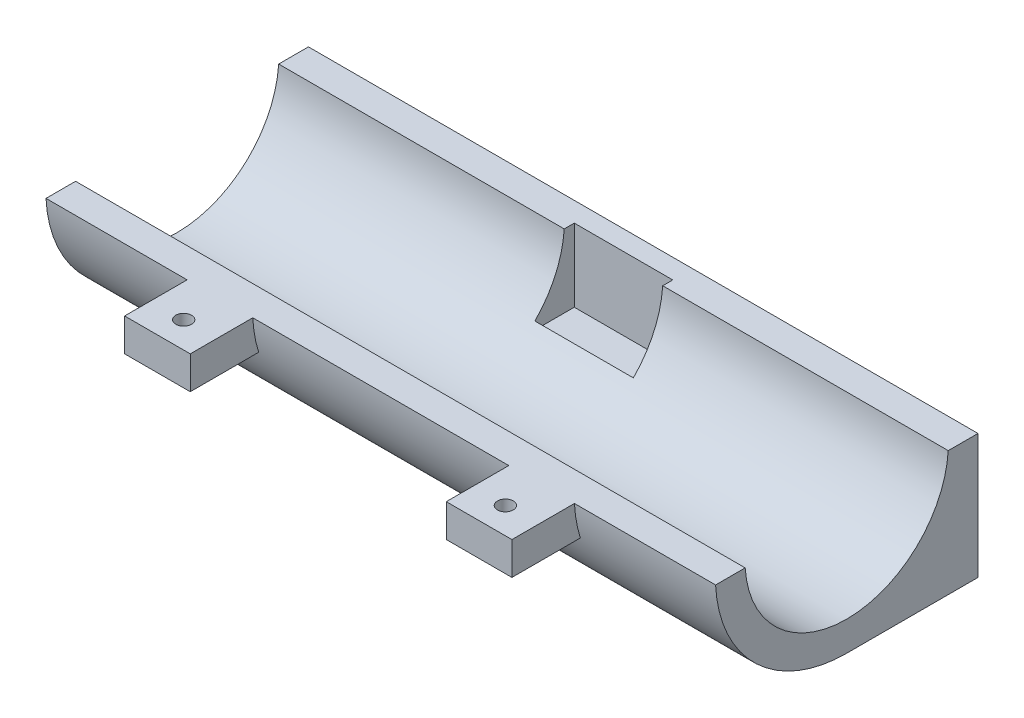
ISO-10303-21;
HEADER;
FILE_DESCRIPTION(('STEP AP214'),'2;1');
FILE_NAME('part.step','',(''),(''),'','','');
FILE_SCHEMA(('AUTOMOTIVE_DESIGN { 1 0 10303 214 1 1 1 1 }'));
ENDSEC;
DATA;
#1=APPLICATION_CONTEXT('core data for automotive mechanical design processes');
#2=APPLICATION_PROTOCOL_DEFINITION('international standard','automotive_design',2000,#1);
#3=PRODUCT_CONTEXT('',#1,'mechanical');
#4=PRODUCT('Part','Part','',(#3));
#5=PRODUCT_RELATED_PRODUCT_CATEGORY('part','',(#4));
#6=PRODUCT_DEFINITION_FORMATION('','',#4);
#7=PRODUCT_DEFINITION_CONTEXT('part definition',#1,'design');
#8=PRODUCT_DEFINITION('design','',#6,#7);
#9=PRODUCT_DEFINITION_SHAPE('','',#8);
#10=(LENGTH_UNIT() NAMED_UNIT(*) SI_UNIT(.MILLI.,.METRE.));
#11=(NAMED_UNIT(*) PLANE_ANGLE_UNIT() SI_UNIT($,.RADIAN.));
#12=(NAMED_UNIT(*) SI_UNIT($,.STERADIAN.) SOLID_ANGLE_UNIT());
#13=UNCERTAINTY_MEASURE_WITH_UNIT(LENGTH_MEASURE(1.E-05),#10,'distance_accuracy_value','');
#14=(GEOMETRIC_REPRESENTATION_CONTEXT(3) GLOBAL_UNCERTAINTY_ASSIGNED_CONTEXT((#13)) GLOBAL_UNIT_ASSIGNED_CONTEXT((#10,
#11,#12)) REPRESENTATION_CONTEXT('',''));
#15=CARTESIAN_POINT('',(0.,0.,0.));
#16=DIRECTION('',(0.,0.,1.));
#17=DIRECTION('',(1.,0.,0.));
#18=AXIS2_PLACEMENT_3D('',#15,#16,#17);
#19=CARTESIAN_POINT('',(0.,1.14590202813815,3.94518317727533));
#20=DIRECTION('',(1.,0.,0.));
#21=DIRECTION('',(0.,0.,-1.));
#22=AXIS2_PLACEMENT_3D('',#19,#20,#21);
#23=CYLINDRICAL_SURFACE('',#22,10.);
#24=CARTESIAN_POINT('',(51.,1.14590202813815,3.94518317727533));
#25=DIRECTION('',(-1.,0.,0.));
#26=DIRECTION('',(0.,0.,-1.));
#27=AXIS2_PLACEMENT_3D('',#24,#25,#26);
#28=CIRCLE('',#27,10.);
#29=CARTESIAN_POINT('',(51.,-8.85409797186184,3.94518317727534));
#30=VERTEX_POINT('',#29);
#31=CARTESIAN_POINT('',(51.,0.645902028138152,13.9326753549944));
#32=VERTEX_POINT('',#31);
#33=EDGE_CURVE('E183',#30,#32,#28,.T.);
#34=ORIENTED_EDGE('',*,*,#33,.T.);
#35=DIRECTION('',(1.,0.,0.));
#36=VECTOR('',#35,1.);
#37=CARTESIAN_POINT('',(0.,0.645902028138152,13.9326753549944));
#38=LINE('',#37,#36);
#39=CARTESIAN_POINT('',(40.25,0.645902028138152,13.9326753549944));
#40=VERTEX_POINT('',#39);
#41=EDGE_CURVE('E163',#32,#40,#38,.F.);
#42=ORIENTED_EDGE('',*,*,#41,.T.);
#43=CARTESIAN_POINT('',(40.25,1.14590202813815,3.94518317727533));
#44=DIRECTION('',(-1.,0.,0.));
#45=DIRECTION('',(0.,0.,-1.));
#46=AXIS2_PLACEMENT_3D('',#43,#44,#45);
#47=CIRCLE('',#46,10.);
#48=CARTESIAN_POINT('',(40.25,-1.85409797186185,13.4845751914448));
#49=VERTEX_POINT('',#48);
#50=EDGE_CURVE('E249',#49,#40,#47,.T.);
#51=ORIENTED_EDGE('',*,*,#50,.F.);
#52=DIRECTION('',(1.,0.,0.));
#53=VECTOR('',#52,1.);
#54=CARTESIAN_POINT('',(0.,-1.85409797186185,13.4845751914448));
#55=LINE('',#54,#53);
#56=CARTESIAN_POINT('',(35.25,-1.85409797186185,13.4845751914448));
#57=VERTEX_POINT('',#56);
#58=EDGE_CURVE('E11',#49,#57,#55,.F.);
#59=ORIENTED_EDGE('',*,*,#58,.T.);
#60=CARTESIAN_POINT('',(35.25,1.14590202813815,3.94518317727533));
#61=DIRECTION('',(1.,0.,0.));
#62=DIRECTION('',(0.,0.,1.));
#63=AXIS2_PLACEMENT_3D('',#60,#61,#62);
#64=CIRCLE('',#63,10.);
#65=CARTESIAN_POINT('',(35.25,0.645902028138152,13.9326753549944));
#66=VERTEX_POINT('',#65);
#67=EDGE_CURVE('E356',#66,#57,#64,.T.);
#68=ORIENTED_EDGE('',*,*,#67,.F.);
#69=CARTESIAN_POINT('',(15.75,0.645902028138152,13.9326753549944));
#70=VERTEX_POINT('',#69);
#71=EDGE_CURVE('E177',#66,#70,#38,.F.);
#72=ORIENTED_EDGE('',*,*,#71,.T.);
#73=CARTESIAN_POINT('',(15.75,1.14590202813815,3.94518317727533));
#74=DIRECTION('',(-1.,0.,0.));
#75=DIRECTION('',(0.,0.,-1.));
#76=AXIS2_PLACEMENT_3D('',#73,#74,#75);
#77=CIRCLE('',#76,10.);
#78=CARTESIAN_POINT('',(15.75,-1.85409797186185,13.4845751914448));
#79=VERTEX_POINT('',#78);
#80=EDGE_CURVE('E238',#79,#70,#77,.T.);
#81=ORIENTED_EDGE('',*,*,#80,.F.);
#82=CARTESIAN_POINT('',(10.75,-1.85409797186185,13.4845751914448));
#83=VERTEX_POINT('',#82);
#84=EDGE_CURVE('E42',#79,#83,#55,.F.);
#85=ORIENTED_EDGE('',*,*,#84,.T.);
#86=CARTESIAN_POINT('',(10.75,1.14590202813815,3.94518317727533));
#87=DIRECTION('',(1.,0.,0.));
#88=DIRECTION('',(0.,0.,1.));
#89=AXIS2_PLACEMENT_3D('',#86,#87,#88);
#90=CIRCLE('',#89,10.);
#91=CARTESIAN_POINT('',(10.75,0.645902028138152,13.9326753549944));
#92=VERTEX_POINT('',#91);
#93=EDGE_CURVE('E235',#92,#83,#90,.T.);
#94=ORIENTED_EDGE('',*,*,#93,.F.);
#95=CARTESIAN_POINT('',(0.,0.645902028138152,13.9326753549944));
#96=VERTEX_POINT('',#95);
#97=EDGE_CURVE('E176',#92,#96,#38,.F.);
#98=ORIENTED_EDGE('',*,*,#97,.T.);
#99=CARTESIAN_POINT('',(0.,1.14590202813815,3.94518317727533));
#100=DIRECTION('',(-1.,0.,0.));
#101=DIRECTION('',(0.,0.,-1.));
#102=AXIS2_PLACEMENT_3D('',#99,#100,#101);
#103=CIRCLE('',#102,10.);
#104=CARTESIAN_POINT('',(0.,-8.85409797186184,3.94518317727534));
#105=VERTEX_POINT('',#104);
#106=EDGE_CURVE('E193',#105,#96,#103,.T.);
#107=ORIENTED_EDGE('',*,*,#106,.F.);
#108=DIRECTION('',(1.,0.,0.));
#109=VECTOR('',#108,1.);
#110=CARTESIAN_POINT('',(0.,-8.85409797186184,3.94518317727534));
#111=LINE('',#110,#109);
#112=EDGE_CURVE('E192',#105,#30,#111,.T.);
#113=ORIENTED_EDGE('',*,*,#112,.T.);
#114=EDGE_LOOP('',(#34,#42,#51,#59,#68,#72,#81,#85,#94,#98,#107,#113));
#115=FACE_BOUND('',#114,.T.);
#116=ADVANCED_FACE('F33',(#115),#23,.T.);
#117=CARTESIAN_POINT('',(0.,-1.85409797186185,11.6951831772753));
#118=DIRECTION('',(0.,-1.,0.));
#119=DIRECTION('',(0.,0.,-1.));
#120=AXIS2_PLACEMENT_3D('',#117,#118,#119);
#121=PLANE('',#120);
#122=CARTESIAN_POINT('',(13.25,-1.85409797186185,16.6951831772753));
#123=DIRECTION('',(0.,-1.,0.));
#124=DIRECTION('',(0.,0.,-1.));
#125=AXIS2_PLACEMENT_3D('',#122,#123,#124);
#126=CIRCLE('',#125,0.6);
#127=CARTESIAN_POINT('',(13.25,-1.85409797186185,16.0951831772753));
#128=VERTEX_POINT('',#127);
#129=EDGE_CURVE('E302',#128,#128,#126,.T.);
#130=ORIENTED_EDGE('',*,*,#129,.F.);
#131=EDGE_LOOP('',(#130));
#132=FACE_BOUND('',#131,.T.);
#133=ORIENTED_EDGE('',*,*,#84,.F.);
#134=DIRECTION('',(0.,0.,-1.));
#135=VECTOR('',#134,1.);
#136=CARTESIAN_POINT('',(15.75,-1.85409797186185,13.4845751914448));
#137=LINE('',#136,#135);
#138=CARTESIAN_POINT('',(15.75,-1.85409797186185,18.6951831772753));
#139=VERTEX_POINT('',#138);
#140=EDGE_CURVE('E361',#139,#79,#137,.T.);
#141=ORIENTED_EDGE('',*,*,#140,.F.);
#142=DIRECTION('',(1.,0.,0.));
#143=VECTOR('',#142,1.);
#144=CARTESIAN_POINT('',(10.75,-1.85409797186185,18.6951831772753));
#145=LINE('',#144,#143);
#146=CARTESIAN_POINT('',(10.75,-1.85409797186185,18.6951831772753));
#147=VERTEX_POINT('',#146);
#148=EDGE_CURVE('E246',#147,#139,#145,.T.);
#149=ORIENTED_EDGE('',*,*,#148,.F.);
#150=DIRECTION('',(0.,0.,1.));
#151=VECTOR('',#150,1.);
#152=CARTESIAN_POINT('',(10.75,-1.85409797186185,17.6951831772753));
#153=LINE('',#152,#151);
#154=EDGE_CURVE('E243',#83,#147,#153,.T.);
#155=ORIENTED_EDGE('',*,*,#154,.F.);
#156=EDGE_LOOP('',(#133,#141,#149,#155));
#157=FACE_BOUND('',#156,.T.);
#158=ADVANCED_FACE('F244',(#132,#157),#121,.T.);
#159=CARTESIAN_POINT('',(37.75,-1.85409797186185,16.6951831772753));
#160=DIRECTION('',(0.,-1.,0.));
#161=DIRECTION('',(0.,0.,-1.));
#162=AXIS2_PLACEMENT_3D('',#159,#160,#161);
#163=CIRCLE('',#162,0.6);
#164=CARTESIAN_POINT('',(37.75,-1.85409797186185,16.0951831772753));
#165=VERTEX_POINT('',#164);
#166=EDGE_CURVE('E298',#165,#165,#163,.T.);
#167=ORIENTED_EDGE('',*,*,#166,.F.);
#168=EDGE_LOOP('',(#167));
#169=FACE_BOUND('',#168,.T.);
#170=DIRECTION('',(0.,0.,-1.));
#171=VECTOR('',#170,1.);
#172=CARTESIAN_POINT('',(40.25,-1.85409797186185,17.6951831772753));
#173=LINE('',#172,#171);
#174=CARTESIAN_POINT('',(40.25,-1.85409797186185,18.6951831772753));
#175=VERTEX_POINT('',#174);
#176=EDGE_CURVE('E251',#175,#49,#173,.T.);
#177=ORIENTED_EDGE('',*,*,#176,.F.);
#178=DIRECTION('',(1.,0.,0.));
#179=VECTOR('',#178,1.);
#180=CARTESIAN_POINT('',(35.25,-1.85409797186185,18.6951831772753));
#181=LINE('',#180,#179);
#182=CARTESIAN_POINT('',(35.25,-1.85409797186185,18.6951831772753));
#183=VERTEX_POINT('',#182);
#184=EDGE_CURVE('E350',#183,#175,#181,.T.);
#185=ORIENTED_EDGE('',*,*,#184,.F.);
#186=DIRECTION('',(0.,0.,1.));
#187=VECTOR('',#186,1.);
#188=CARTESIAN_POINT('',(35.25,-1.85409797186185,17.6951831772753));
#189=LINE('',#188,#187);
#190=EDGE_CURVE('E358',#57,#183,#189,.T.);
#191=ORIENTED_EDGE('',*,*,#190,.F.);
#192=ORIENTED_EDGE('',*,*,#58,.F.);
#193=EDGE_LOOP('',(#177,#185,#191,#192));
#194=FACE_BOUND('',#193,.T.);
#195=ADVANCED_FACE('F385',(#169,#194),#121,.T.);
#196=CARTESIAN_POINT('',(0.,1.14590202813815,3.94518317727533));
#197=DIRECTION('',(1.,0.,0.));
#198=DIRECTION('',(0.,0.,-1.));
#199=AXIS2_PLACEMENT_3D('',#196,#197,#198);
#200=CYLINDRICAL_SURFACE('',#199,7.75);
#201=CARTESIAN_POINT('',(51.,1.14590202813815,3.94518317727533));
#202=DIRECTION('',(1.,0.,0.));
#203=DIRECTION('',(0.,0.,-1.));
#204=AXIS2_PLACEMENT_3D('',#201,#202,#203);
#205=CIRCLE('',#204,7.75);
#206=CARTESIAN_POINT('',(51.,0.645902028138152,11.6790373264043));
#207=VERTEX_POINT('',#206);
#208=CARTESIAN_POINT('',(51.,0.645902028138152,-3.78867097185367));
#209=VERTEX_POINT('',#208);
#210=EDGE_CURVE('E187',#207,#209,#205,.T.);
#211=ORIENTED_EDGE('',*,*,#210,.T.);
#212=DIRECTION('',(1.,0.,0.));
#213=VECTOR('',#212,1.);
#214=CARTESIAN_POINT('',(0.,0.645902028138152,-3.78867097185367));
#215=LINE('',#214,#213);
#216=CARTESIAN_POINT('',(29.25,0.645902028138152,-3.78867097185367));
#217=VERTEX_POINT('',#216);
#218=EDGE_CURVE('E297',#209,#217,#215,.F.);
#219=ORIENTED_EDGE('',*,*,#218,.T.);
#220=CARTESIAN_POINT('',(29.25,1.14590202813815,3.94518317727533));
#221=DIRECTION('',(-1.,0.,0.));
#222=DIRECTION('',(0.,0.,1.));
#223=AXIS2_PLACEMENT_3D('',#220,#221,#222);
#224=CIRCLE('',#223,7.75);
#225=CARTESIAN_POINT('',(29.25,-4.31418038882224,-1.55481682272466));
#226=VERTEX_POINT('',#225);
#227=EDGE_CURVE('E224',#226,#217,#224,.F.);
#228=ORIENTED_EDGE('',*,*,#227,.F.);
#229=DIRECTION('',(1.,0.,0.));
#230=VECTOR('',#229,1.);
#231=CARTESIAN_POINT('',(0.,-4.31418038882224,-1.55481682272466));
#232=LINE('',#231,#230);
#233=CARTESIAN_POINT('',(21.75,-4.31418038882224,-1.55481682272466));
#234=VERTEX_POINT('',#233);
#235=EDGE_CURVE('E217',#226,#234,#232,.F.);
#236=ORIENTED_EDGE('',*,*,#235,.T.);
#237=CARTESIAN_POINT('',(21.75,1.14590202813815,3.94518317727533));
#238=DIRECTION('',(1.,0.,0.));
#239=DIRECTION('',(0.,0.,-1.));
#240=AXIS2_PLACEMENT_3D('',#237,#238,#239);
#241=CIRCLE('',#240,7.75);
#242=CARTESIAN_POINT('',(21.75,0.645902028138152,-3.78867097185367));
#243=VERTEX_POINT('',#242);
#244=EDGE_CURVE('E222',#243,#234,#241,.F.);
#245=ORIENTED_EDGE('',*,*,#244,.F.);
#246=CARTESIAN_POINT('',(0.,0.645902028138152,-3.78867097185367));
#247=VERTEX_POINT('',#246);
#248=EDGE_CURVE('E49',#243,#247,#215,.F.);
#249=ORIENTED_EDGE('',*,*,#248,.T.);
#250=CARTESIAN_POINT('',(0.,1.14590202813815,3.94518317727533));
#251=DIRECTION('',(1.,0.,0.));
#252=DIRECTION('',(0.,0.,-1.));
#253=AXIS2_PLACEMENT_3D('',#250,#251,#252);
#254=CIRCLE('',#253,7.75);
#255=CARTESIAN_POINT('',(0.,0.645902028138152,11.6790373264043));
#256=VERTEX_POINT('',#255);
#257=EDGE_CURVE('E210',#256,#247,#254,.T.);
#258=ORIENTED_EDGE('',*,*,#257,.F.);
#259=DIRECTION('',(1.,0.,0.));
#260=VECTOR('',#259,1.);
#261=CARTESIAN_POINT('',(0.,0.645902028138152,11.6790373264043));
#262=LINE('',#261,#260);
#263=EDGE_CURVE('E312',#256,#207,#262,.T.);
#264=ORIENTED_EDGE('',*,*,#263,.T.);
#265=EDGE_LOOP('',(#211,#219,#228,#236,#245,#249,#258,#264));
#266=FACE_BOUND('',#265,.T.);
#267=ADVANCED_FACE('F294',(#266),#200,.F.);
#268=CARTESIAN_POINT('',(0.,21.1459020281382,-6.05481682272466));
#269=DIRECTION('',(0.,0.,1.));
#270=DIRECTION('',(0.,-1.,0.));
#271=AXIS2_PLACEMENT_3D('',#268,#269,#270);
#272=PLANE('',#271);
#273=DIRECTION('',(0.,-1.,0.));
#274=VECTOR('',#273,1.);
#275=CARTESIAN_POINT('',(0.,21.1459020281382,-6.05481682272466));
#276=LINE('',#275,#274);
#277=CARTESIAN_POINT('',(0.,0.645902028138152,-6.05481682272466));
#278=VERTEX_POINT('',#277);
#279=CARTESIAN_POINT('',(0.,-8.85409797186185,-6.05481682272466));
#280=VERTEX_POINT('',#279);
#281=EDGE_CURVE('E204',#278,#280,#276,.T.);
#282=ORIENTED_EDGE('',*,*,#281,.F.);
#283=DIRECTION('',(1.,0.,0.));
#284=VECTOR('',#283,1.);
#285=CARTESIAN_POINT('',(0.,0.645902028138152,-6.05481682272466));
#286=LINE('',#285,#284);
#287=CARTESIAN_POINT('',(51.,0.645902028138152,-6.05481682272466));
#288=VERTEX_POINT('',#287);
#289=EDGE_CURVE('E299',#278,#288,#286,.T.);
#290=ORIENTED_EDGE('',*,*,#289,.T.);
#291=DIRECTION('',(0.,-1.,0.));
#292=VECTOR('',#291,1.);
#293=CARTESIAN_POINT('',(51.,21.1459020281382,-6.05481682272466));
#294=LINE('',#293,#292);
#295=CARTESIAN_POINT('',(51.,-8.85409797186185,-6.05481682272466));
#296=VERTEX_POINT('',#295);
#297=EDGE_CURVE('E203',#288,#296,#294,.T.);
#298=ORIENTED_EDGE('',*,*,#297,.T.);
#299=DIRECTION('',(1.,0.,0.));
#300=VECTOR('',#299,1.);
#301=CARTESIAN_POINT('',(0.,-8.85409797186185,-6.05481682272466));
#302=LINE('',#301,#300);
#303=EDGE_CURVE('E206',#280,#296,#302,.T.);
#304=ORIENTED_EDGE('',*,*,#303,.F.);
#305=EDGE_LOOP('',(#282,#290,#298,#304));
#306=FACE_BOUND('',#305,.T.);
#307=ADVANCED_FACE('F331',(#306),#272,.F.);
#308=CARTESIAN_POINT('',(51.,-8.85409797186185,20.9451831772753));
#309=DIRECTION('',(0.,1.,0.));
#310=DIRECTION('',(0.,0.,1.));
#311=AXIS2_PLACEMENT_3D('',#308,#309,#310);
#312=PLANE('',#311);
#313=DIRECTION('',(0.,0.,-1.));
#314=VECTOR('',#313,1.);
#315=CARTESIAN_POINT('',(51.,-8.85409797186185,20.9451831772753));
#316=LINE('',#315,#314);
#317=EDGE_CURVE('E215',#30,#296,#316,.T.);
#318=ORIENTED_EDGE('',*,*,#317,.F.);
#319=ORIENTED_EDGE('',*,*,#112,.F.);
#320=DIRECTION('',(0.,0.,-1.));
#321=VECTOR('',#320,1.);
#322=CARTESIAN_POINT('',(0.,-8.85409797186185,20.9451831772753));
#323=LINE('',#322,#321);
#324=EDGE_CURVE('E213',#105,#280,#323,.T.);
#325=ORIENTED_EDGE('',*,*,#324,.T.);
#326=ORIENTED_EDGE('',*,*,#303,.T.);
#327=EDGE_LOOP('',(#318,#319,#325,#326));
#328=FACE_BOUND('',#327,.T.);
#329=ADVANCED_FACE('F35',(#328),#312,.F.);
#330=CARTESIAN_POINT('',(51.,0.,0.));
#331=DIRECTION('',(1.,0.,0.));
#332=DIRECTION('',(0.,0.,-1.));
#333=AXIS2_PLACEMENT_3D('',#330,#331,#332);
#334=PLANE('',#333);
#335=DIRECTION('',(0.,0.,-1.));
#336=VECTOR('',#335,1.);
#337=CARTESIAN_POINT('',(51.,0.645902028138152,18.6951831772753));
#338=LINE('',#337,#336);
#339=EDGE_CURVE('E166',#32,#207,#338,.T.);
#340=ORIENTED_EDGE('',*,*,#339,.F.);
#341=ORIENTED_EDGE('',*,*,#33,.F.);
#342=ORIENTED_EDGE('',*,*,#317,.T.);
#343=ORIENTED_EDGE('',*,*,#297,.F.);
#344=EDGE_CURVE('E189',#209,#288,#338,.T.);
#345=ORIENTED_EDGE('',*,*,#344,.F.);
#346=ORIENTED_EDGE('',*,*,#210,.F.);
#347=EDGE_LOOP('',(#340,#341,#342,#343,#345,#346));
#348=FACE_BOUND('',#347,.T.);
#349=ADVANCED_FACE('F181',(#348),#334,.T.);
#350=CARTESIAN_POINT('',(0.,0.,0.));
#351=DIRECTION('',(1.,0.,0.));
#352=DIRECTION('',(0.,0.,-1.));
#353=AXIS2_PLACEMENT_3D('',#350,#351,#352);
#354=PLANE('',#353);
#355=ORIENTED_EDGE('',*,*,#106,.T.);
#356=DIRECTION('',(0.,0.,-1.));
#357=VECTOR('',#356,1.);
#358=CARTESIAN_POINT('',(0.,0.645902028138152,0.));
#359=LINE('',#358,#357);
#360=EDGE_CURVE('E314',#96,#256,#359,.T.);
#361=ORIENTED_EDGE('',*,*,#360,.T.);
#362=ORIENTED_EDGE('',*,*,#257,.T.);
#363=EDGE_CURVE('E305',#247,#278,#359,.T.);
#364=ORIENTED_EDGE('',*,*,#363,.T.);
#365=ORIENTED_EDGE('',*,*,#281,.T.);
#366=ORIENTED_EDGE('',*,*,#324,.F.);
#367=EDGE_LOOP('',(#355,#361,#362,#364,#365,#366));
#368=FACE_BOUND('',#367,.T.);
#369=ADVANCED_FACE('F336',(#368),#354,.F.);
#370=CARTESIAN_POINT('',(0.,0.,-4.55481682272466));
#371=DIRECTION('',(0.,0.,1.));
#372=DIRECTION('',(0.,-1.,0.));
#373=AXIS2_PLACEMENT_3D('',#370,#371,#372);
#374=PLANE('',#373);
#375=DIRECTION('',(1.,0.,0.));
#376=VECTOR('',#375,1.);
#377=CARTESIAN_POINT('',(0.,0.645902028138152,-4.55481682272466));
#378=LINE('',#377,#376);
#379=CARTESIAN_POINT('',(21.75,0.645902028138152,-4.55481682272466));
#380=VERTEX_POINT('',#379);
#381=CARTESIAN_POINT('',(29.25,0.645902028138152,-4.55481682272466));
#382=VERTEX_POINT('',#381);
#383=EDGE_CURVE('E291',#380,#382,#378,.T.);
#384=ORIENTED_EDGE('',*,*,#383,.F.);
#385=DIRECTION('',(0.,1.,0.));
#386=VECTOR('',#385,1.);
#387=CARTESIAN_POINT('',(21.75,-2.18013164577437,-4.55481682272466));
#388=LINE('',#387,#386);
#389=CARTESIAN_POINT('',(21.75,-4.90409797186185,-4.55481682272466));
#390=VERTEX_POINT('',#389);
#391=EDGE_CURVE('E266',#390,#380,#388,.T.);
#392=ORIENTED_EDGE('',*,*,#391,.F.);
#393=DIRECTION('',(-1.,0.,0.));
#394=VECTOR('',#393,1.);
#395=CARTESIAN_POINT('',(21.75,-4.90409797186185,-4.55481682272466));
#396=LINE('',#395,#394);
#397=CARTESIAN_POINT('',(29.25,-4.90409797186185,-4.55481682272466));
#398=VERTEX_POINT('',#397);
#399=EDGE_CURVE('E271',#398,#390,#396,.T.);
#400=ORIENTED_EDGE('',*,*,#399,.F.);
#401=DIRECTION('',(0.,-1.,0.));
#402=VECTOR('',#401,1.);
#403=CARTESIAN_POINT('',(29.25,-2.18013164577437,-4.55481682272466));
#404=LINE('',#403,#402);
#405=EDGE_CURVE('E269',#382,#398,#404,.T.);
#406=ORIENTED_EDGE('',*,*,#405,.F.);
#407=EDGE_LOOP('',(#384,#392,#400,#406));
#408=FACE_BOUND('',#407,.T.);
#409=ADVANCED_FACE('F290',(#408),#374,.T.);
#410=CARTESIAN_POINT('',(29.25,-2.18013164577437,-4.55481682272466));
#411=DIRECTION('',(-1.,0.,0.));
#412=DIRECTION('',(0.,0.,1.));
#413=AXIS2_PLACEMENT_3D('',#410,#411,#412);
#414=PLANE('',#413);
#415=DIRECTION('',(0.,0.,1.));
#416=VECTOR('',#415,1.);
#417=CARTESIAN_POINT('',(29.25,0.645902028138152,-4.55481682272466));
#418=LINE('',#417,#416);
#419=EDGE_CURVE('E309',#382,#217,#418,.T.);
#420=ORIENTED_EDGE('',*,*,#419,.F.);
#421=ORIENTED_EDGE('',*,*,#405,.T.);
#422=DIRECTION('',(0.,0.,1.));
#423=VECTOR('',#422,1.);
#424=CARTESIAN_POINT('',(29.25,-4.90409797186185,-4.55481682272466));
#425=LINE('',#424,#423);
#426=CARTESIAN_POINT('',(29.25,-4.90409797186185,-1.55481682272466));
#427=VERTEX_POINT('',#426);
#428=EDGE_CURVE('E194',#398,#427,#425,.T.);
#429=ORIENTED_EDGE('',*,*,#428,.T.);
#430=DIRECTION('',(0.,-1.,0.));
#431=VECTOR('',#430,1.);
#432=CARTESIAN_POINT('',(29.25,-2.18013164577437,-1.55481682272466));
#433=LINE('',#432,#431);
#434=EDGE_CURVE('E261',#226,#427,#433,.T.);
#435=ORIENTED_EDGE('',*,*,#434,.F.);
#436=ORIENTED_EDGE('',*,*,#227,.T.);
#437=EDGE_LOOP('',(#420,#421,#429,#435,#436));
#438=FACE_BOUND('',#437,.T.);
#439=ADVANCED_FACE('F286',(#438),#414,.T.);
#440=CARTESIAN_POINT('',(21.75,-2.18013164577437,-4.55481682272466));
#441=DIRECTION('',(1.,0.,0.));
#442=DIRECTION('',(0.,0.,-1.));
#443=AXIS2_PLACEMENT_3D('',#440,#441,#442);
#444=PLANE('',#443);
#445=DIRECTION('',(0.,0.,-1.));
#446=VECTOR('',#445,1.);
#447=CARTESIAN_POINT('',(21.75,0.645902028138152,-4.55481682272466));
#448=LINE('',#447,#446);
#449=EDGE_CURVE('E174',#243,#380,#448,.T.);
#450=ORIENTED_EDGE('',*,*,#449,.F.);
#451=ORIENTED_EDGE('',*,*,#244,.T.);
#452=DIRECTION('',(0.,1.,0.));
#453=VECTOR('',#452,1.);
#454=CARTESIAN_POINT('',(21.75,-2.18013164577437,-1.55481682272466));
#455=LINE('',#454,#453);
#456=CARTESIAN_POINT('',(21.75,-4.90409797186185,-1.55481682272466));
#457=VERTEX_POINT('',#456);
#458=EDGE_CURVE('E258',#457,#234,#455,.T.);
#459=ORIENTED_EDGE('',*,*,#458,.F.);
#460=DIRECTION('',(0.,0.,1.));
#461=VECTOR('',#460,1.);
#462=CARTESIAN_POINT('',(21.75,-4.90409797186185,-4.55481682272466));
#463=LINE('',#462,#461);
#464=EDGE_CURVE('E199',#390,#457,#463,.T.);
#465=ORIENTED_EDGE('',*,*,#464,.F.);
#466=ORIENTED_EDGE('',*,*,#391,.T.);
#467=EDGE_LOOP('',(#450,#451,#459,#465,#466));
#468=FACE_BOUND('',#467,.T.);
#469=ADVANCED_FACE('F282',(#468),#444,.T.);
#470=CARTESIAN_POINT('',(0.,0.,-1.55481682272466));
#471=DIRECTION('',(0.,0.,1.));
#472=DIRECTION('',(0.,-1.,0.));
#473=AXIS2_PLACEMENT_3D('',#470,#471,#472);
#474=PLANE('',#473);
#475=ORIENTED_EDGE('',*,*,#434,.T.);
#476=DIRECTION('',(-1.,0.,0.));
#477=VECTOR('',#476,1.);
#478=CARTESIAN_POINT('',(21.75,-4.90409797186185,-1.55481682272466));
#479=LINE('',#478,#477);
#480=EDGE_CURVE('E263',#427,#457,#479,.T.);
#481=ORIENTED_EDGE('',*,*,#480,.T.);
#482=ORIENTED_EDGE('',*,*,#458,.T.);
#483=ORIENTED_EDGE('',*,*,#235,.F.);
#484=EDGE_LOOP('',(#475,#481,#482,#483));
#485=FACE_BOUND('',#484,.T.);
#486=ADVANCED_FACE('F285',(#485),#474,.F.);
#487=CARTESIAN_POINT('',(21.75,-4.90409797186185,-4.55481682272466));
#488=DIRECTION('',(0.,1.,0.));
#489=DIRECTION('',(0.,0.,1.));
#490=AXIS2_PLACEMENT_3D('',#487,#488,#489);
#491=PLANE('',#490);
#492=ORIENTED_EDGE('',*,*,#428,.F.);
#493=ORIENTED_EDGE('',*,*,#399,.T.);
#494=ORIENTED_EDGE('',*,*,#464,.T.);
#495=ORIENTED_EDGE('',*,*,#480,.F.);
#496=EDGE_LOOP('',(#492,#493,#494,#495));
#497=FACE_BOUND('',#496,.T.);
#498=ADVANCED_FACE('F279',(#497),#491,.T.);
#499=CARTESIAN_POINT('',(40.25,1.14590202813815,3.94518317727533));
#500=DIRECTION('',(1.,0.,0.));
#501=DIRECTION('',(0.,0.,-1.));
#502=AXIS2_PLACEMENT_3D('',#499,#500,#501);
#503=PLANE('',#502);
#504=DIRECTION('',(0.,0.,-1.));
#505=VECTOR('',#504,1.);
#506=CARTESIAN_POINT('',(40.25,0.645902028138152,3.94518317727533));
#507=LINE('',#506,#505);
#508=CARTESIAN_POINT('',(40.25,0.645902028138152,18.6951831772753));
#509=VERTEX_POINT('',#508);
#510=EDGE_CURVE('E169',#509,#40,#507,.T.);
#511=ORIENTED_EDGE('',*,*,#510,.F.);
#512=DIRECTION('',(0.,1.,0.));
#513=VECTOR('',#512,1.);
#514=CARTESIAN_POINT('',(40.25,-1.85409797186185,18.6951831772753));
#515=LINE('',#514,#513);
#516=EDGE_CURVE('E353',#175,#509,#515,.T.);
#517=ORIENTED_EDGE('',*,*,#516,.F.);
#518=ORIENTED_EDGE('',*,*,#176,.T.);
#519=ORIENTED_EDGE('',*,*,#50,.T.);
#520=EDGE_LOOP('',(#511,#517,#518,#519));
#521=FACE_BOUND('',#520,.T.);
#522=ADVANCED_FACE('F396',(#521),#503,.T.);
#523=CARTESIAN_POINT('',(10.75,1.14590202813815,3.94518317727533));
#524=DIRECTION('',(-1.,0.,0.));
#525=DIRECTION('',(0.,0.,1.));
#526=AXIS2_PLACEMENT_3D('',#523,#524,#525);
#527=PLANE('',#526);
#528=DIRECTION('',(0.,0.,1.));
#529=VECTOR('',#528,1.);
#530=CARTESIAN_POINT('',(10.75,0.645902028138152,3.94518317727533));
#531=LINE('',#530,#529);
#532=CARTESIAN_POINT('',(10.75,0.645902028138152,18.6951831772753));
#533=VERTEX_POINT('',#532);
#534=EDGE_CURVE('E57',#92,#533,#531,.T.);
#535=ORIENTED_EDGE('',*,*,#534,.F.);
#536=ORIENTED_EDGE('',*,*,#93,.T.);
#537=ORIENTED_EDGE('',*,*,#154,.T.);
#538=DIRECTION('',(0.,-1.,0.));
#539=VECTOR('',#538,1.);
#540=CARTESIAN_POINT('',(10.75,-1.85409797186185,18.6951831772753));
#541=LINE('',#540,#539);
#542=EDGE_CURVE('E338',#533,#147,#541,.T.);
#543=ORIENTED_EDGE('',*,*,#542,.F.);
#544=EDGE_LOOP('',(#535,#536,#537,#543));
#545=FACE_BOUND('',#544,.T.);
#546=ADVANCED_FACE('F337',(#545),#527,.T.);
#547=CARTESIAN_POINT('',(15.75,1.14590202813815,3.94518317727533));
#548=DIRECTION('',(1.,0.,0.));
#549=DIRECTION('',(0.,0.,-1.));
#550=AXIS2_PLACEMENT_3D('',#547,#548,#549);
#551=PLANE('',#550);
#552=DIRECTION('',(0.,0.,-1.));
#553=VECTOR('',#552,1.);
#554=CARTESIAN_POINT('',(15.75,0.645902028138152,3.94518317727533));
#555=LINE('',#554,#553);
#556=CARTESIAN_POINT('',(15.75,0.645902028138152,18.6951831772753));
#557=VERTEX_POINT('',#556);
#558=EDGE_CURVE('E318',#557,#70,#555,.T.);
#559=ORIENTED_EDGE('',*,*,#558,.F.);
#560=DIRECTION('',(0.,1.,0.));
#561=VECTOR('',#560,1.);
#562=CARTESIAN_POINT('',(15.75,-1.85409797186185,18.6951831772753));
#563=LINE('',#562,#561);
#564=EDGE_CURVE('E341',#139,#557,#563,.T.);
#565=ORIENTED_EDGE('',*,*,#564,.F.);
#566=ORIENTED_EDGE('',*,*,#140,.T.);
#567=ORIENTED_EDGE('',*,*,#80,.T.);
#568=EDGE_LOOP('',(#559,#565,#566,#567));
#569=FACE_BOUND('',#568,.T.);
#570=ADVANCED_FACE('F364',(#569),#551,.T.);
#571=CARTESIAN_POINT('',(35.25,1.14590202813815,3.94518317727533));
#572=DIRECTION('',(-1.,0.,0.));
#573=DIRECTION('',(0.,0.,1.));
#574=AXIS2_PLACEMENT_3D('',#571,#572,#573);
#575=PLANE('',#574);
#576=DIRECTION('',(0.,0.,1.));
#577=VECTOR('',#576,1.);
#578=CARTESIAN_POINT('',(35.25,0.645902028138152,3.94518317727533));
#579=LINE('',#578,#577);
#580=CARTESIAN_POINT('',(35.25,0.645902028138152,18.6951831772753));
#581=VERTEX_POINT('',#580);
#582=EDGE_CURVE('E320',#66,#581,#579,.T.);
#583=ORIENTED_EDGE('',*,*,#582,.F.);
#584=ORIENTED_EDGE('',*,*,#67,.T.);
#585=ORIENTED_EDGE('',*,*,#190,.T.);
#586=DIRECTION('',(0.,-1.,0.));
#587=VECTOR('',#586,1.);
#588=CARTESIAN_POINT('',(35.25,-1.85409797186185,18.6951831772753));
#589=LINE('',#588,#587);
#590=EDGE_CURVE('E348',#581,#183,#589,.T.);
#591=ORIENTED_EDGE('',*,*,#590,.F.);
#592=EDGE_LOOP('',(#583,#584,#585,#591));
#593=FACE_BOUND('',#592,.T.);
#594=ADVANCED_FACE('F453',(#593),#575,.T.);
#595=CARTESIAN_POINT('',(0.,0.,18.6951831772753));
#596=DIRECTION('',(0.,0.,-1.));
#597=DIRECTION('',(-1.,0.,0.));
#598=AXIS2_PLACEMENT_3D('',#595,#596,#597);
#599=PLANE('',#598);
#600=ORIENTED_EDGE('',*,*,#516,.T.);
#601=DIRECTION('',(1.,0.,0.));
#602=VECTOR('',#601,1.);
#603=CARTESIAN_POINT('',(-9.,0.645902028138152,18.6951831772753));
#604=LINE('',#603,#602);
#605=EDGE_CURVE('E188',#581,#509,#604,.T.);
#606=ORIENTED_EDGE('',*,*,#605,.F.);
#607=ORIENTED_EDGE('',*,*,#590,.T.);
#608=ORIENTED_EDGE('',*,*,#184,.T.);
#609=EDGE_LOOP('',(#600,#606,#607,#608));
#610=FACE_BOUND('',#609,.T.);
#611=ADVANCED_FACE('F460',(#610),#599,.F.);
#612=CARTESIAN_POINT('',(0.,0.,18.6951831772753));
#613=DIRECTION('',(0.,0.,-1.));
#614=DIRECTION('',(-1.,0.,0.));
#615=AXIS2_PLACEMENT_3D('',#612,#613,#614);
#616=PLANE('',#615);
#617=ORIENTED_EDGE('',*,*,#564,.T.);
#618=EDGE_CURVE('E325',#533,#557,#604,.T.);
#619=ORIENTED_EDGE('',*,*,#618,.F.);
#620=ORIENTED_EDGE('',*,*,#542,.T.);
#621=ORIENTED_EDGE('',*,*,#148,.T.);
#622=EDGE_LOOP('',(#617,#619,#620,#621));
#623=FACE_BOUND('',#622,.T.);
#624=ADVANCED_FACE('F366',(#623),#616,.F.);
#625=CARTESIAN_POINT('',(13.25,-15.8540979718618,16.6951831772753));
#626=DIRECTION('',(0.,1.,0.));
#627=DIRECTION('',(0.,0.,1.));
#628=AXIS2_PLACEMENT_3D('',#625,#626,#627);
#629=CYLINDRICAL_SURFACE('',#628,0.6);
#630=CARTESIAN_POINT('',(13.25,0.645902028138152,16.6951831772753));
#631=DIRECTION('',(0.,-1.,0.));
#632=DIRECTION('',(0.,0.,-1.));
#633=AXIS2_PLACEMENT_3D('',#630,#631,#632);
#634=CIRCLE('',#633,0.6);
#635=CARTESIAN_POINT('',(13.25,0.645902028138152,16.0951831772753));
#636=VERTEX_POINT('',#635);
#637=EDGE_CURVE('E322',#636,#636,#634,.F.);
#638=ORIENTED_EDGE('',*,*,#637,.T.);
#639=EDGE_LOOP('',(#638));
#640=FACE_BOUND('',#639,.T.);
#641=ORIENTED_EDGE('',*,*,#129,.T.);
#642=EDGE_LOOP('',(#641));
#643=FACE_BOUND('',#642,.T.);
#644=ADVANCED_FACE('F378',(#640,#643),#629,.F.);
#645=CARTESIAN_POINT('',(37.75,-15.8540979718618,16.6951831772753));
#646=DIRECTION('',(0.,1.,0.));
#647=DIRECTION('',(0.,0.,1.));
#648=AXIS2_PLACEMENT_3D('',#645,#646,#647);
#649=CYLINDRICAL_SURFACE('',#648,0.6);
#650=CARTESIAN_POINT('',(37.75,0.645902028138152,16.6951831772753));
#651=DIRECTION('',(0.,-1.,0.));
#652=DIRECTION('',(0.,0.,-1.));
#653=AXIS2_PLACEMENT_3D('',#650,#651,#652);
#654=CIRCLE('',#653,0.6);
#655=CARTESIAN_POINT('',(37.75,0.645902028138152,16.0951831772753));
#656=VERTEX_POINT('',#655);
#657=EDGE_CURVE('E37',#656,#656,#654,.F.);
#658=ORIENTED_EDGE('',*,*,#657,.T.);
#659=EDGE_LOOP('',(#658));
#660=FACE_BOUND('',#659,.T.);
#661=ORIENTED_EDGE('',*,*,#166,.T.);
#662=EDGE_LOOP('',(#661));
#663=FACE_BOUND('',#662,.T.);
#664=ADVANCED_FACE('F370',(#660,#663),#649,.F.);
#665=CARTESIAN_POINT('',(-9.,0.645902028138152,18.6951831772753));
#666=DIRECTION('',(0.,-1.,0.));
#667=DIRECTION('',(0.,0.,-1.));
#668=AXIS2_PLACEMENT_3D('',#665,#666,#667);
#669=PLANE('',#668);
#670=ORIENTED_EDGE('',*,*,#657,.F.);
#671=EDGE_LOOP('',(#670));
#672=FACE_BOUND('',#671,.T.);
#673=ORIENTED_EDGE('',*,*,#637,.F.);
#674=EDGE_LOOP('',(#673));
#675=FACE_BOUND('',#674,.T.);
#676=ORIENTED_EDGE('',*,*,#339,.T.);
#677=ORIENTED_EDGE('',*,*,#263,.F.);
#678=ORIENTED_EDGE('',*,*,#360,.F.);
#679=ORIENTED_EDGE('',*,*,#97,.F.);
#680=ORIENTED_EDGE('',*,*,#534,.T.);
#681=ORIENTED_EDGE('',*,*,#618,.T.);
#682=ORIENTED_EDGE('',*,*,#558,.T.);
#683=ORIENTED_EDGE('',*,*,#71,.F.);
#684=ORIENTED_EDGE('',*,*,#582,.T.);
#685=ORIENTED_EDGE('',*,*,#605,.T.);
#686=ORIENTED_EDGE('',*,*,#510,.T.);
#687=ORIENTED_EDGE('',*,*,#41,.F.);
#688=EDGE_LOOP('',(#676,#677,#678,#679,#680,#681,#682,#683,#684,#685,#686,#687));
#689=FACE_BOUND('',#688,.T.);
#690=ADVANCED_FACE('F165',(#672,#675,#689),#669,.F.);
#691=ORIENTED_EDGE('',*,*,#344,.T.);
#692=ORIENTED_EDGE('',*,*,#289,.F.);
#693=ORIENTED_EDGE('',*,*,#363,.F.);
#694=ORIENTED_EDGE('',*,*,#248,.F.);
#695=ORIENTED_EDGE('',*,*,#449,.T.);
#696=ORIENTED_EDGE('',*,*,#383,.T.);
#697=ORIENTED_EDGE('',*,*,#419,.T.);
#698=ORIENTED_EDGE('',*,*,#218,.F.);
#699=EDGE_LOOP('',(#691,#692,#693,#694,#695,#696,#697,#698));
#700=FACE_BOUND('',#699,.T.);
#701=ADVANCED_FACE('F326',(#700),#669,.F.);
#702=CLOSED_SHELL('',(#116,#158,#195,#267,#307,#329,#349,#369,#409,#439,#469,#486,#498,#522,
#546,#570,#594,#611,#624,#644,#664,#690,#701));
#703=MANIFOLD_SOLID_BREP('B2',#702);
#704=ADVANCED_BREP_SHAPE_REPRESENTATION('',(#18,#703),#14);
#705=SHAPE_DEFINITION_REPRESENTATION(#9,#704);
ENDSEC;
END-ISO-10303-21;
